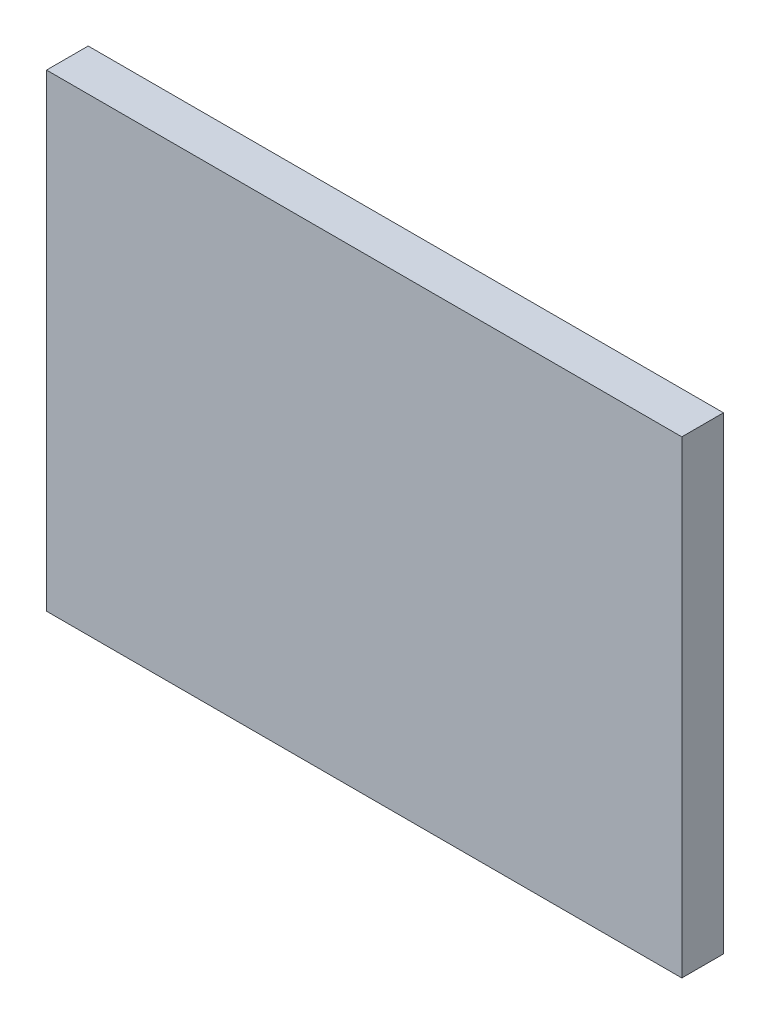
ISO-10303-21;
HEADER;
FILE_DESCRIPTION(('STEP AP214'),'2;1');
FILE_NAME('part.step','',(''),(''),'','','');
FILE_SCHEMA(('AUTOMOTIVE_DESIGN { 1 0 10303 214 1 1 1 1 }'));
ENDSEC;
DATA;
#1=APPLICATION_CONTEXT('core data for automotive mechanical design processes');
#2=APPLICATION_PROTOCOL_DEFINITION('international standard','automotive_design',2000,#1);
#3=PRODUCT_CONTEXT('',#1,'mechanical');
#4=PRODUCT('Part','Part','',(#3));
#5=PRODUCT_RELATED_PRODUCT_CATEGORY('part','',(#4));
#6=PRODUCT_DEFINITION_FORMATION('','',#4);
#7=PRODUCT_DEFINITION_CONTEXT('part definition',#1,'design');
#8=PRODUCT_DEFINITION('design','',#6,#7);
#9=PRODUCT_DEFINITION_SHAPE('','',#8);
#10=(LENGTH_UNIT() NAMED_UNIT(*) SI_UNIT(.MILLI.,.METRE.));
#11=(NAMED_UNIT(*) PLANE_ANGLE_UNIT() SI_UNIT($,.RADIAN.));
#12=(NAMED_UNIT(*) SI_UNIT($,.STERADIAN.) SOLID_ANGLE_UNIT());
#13=UNCERTAINTY_MEASURE_WITH_UNIT(LENGTH_MEASURE(1.E-05),#10,'distance_accuracy_value','');
#14=(GEOMETRIC_REPRESENTATION_CONTEXT(3) GLOBAL_UNCERTAINTY_ASSIGNED_CONTEXT((#13)) GLOBAL_UNIT_ASSIGNED_CONTEXT((#10,
#11,#12)) REPRESENTATION_CONTEXT('',''));
#15=CARTESIAN_POINT('',(0.,0.,0.));
#16=DIRECTION('',(0.,0.,1.));
#17=DIRECTION('',(1.,0.,0.));
#18=AXIS2_PLACEMENT_3D('',#15,#16,#17);
#19=CARTESIAN_POINT('',(0.,0.,4.));
#20=DIRECTION('',(1.,0.,0.));
#21=DIRECTION('',(0.,0.,-1.));
#22=AXIS2_PLACEMENT_3D('',#19,#20,#21);
#23=PLANE('',#22);
#24=DIRECTION('',(0.,-1.,0.));
#25=VECTOR('',#24,1.);
#26=CARTESIAN_POINT('',(0.,0.,0.));
#27=LINE('',#26,#25);
#28=CARTESIAN_POINT('',(0.,45.,0.));
#29=VERTEX_POINT('',#28);
#30=CARTESIAN_POINT('',(0.,0.,0.));
#31=VERTEX_POINT('',#30);
#32=EDGE_CURVE('E96',#29,#31,#27,.T.);
#33=ORIENTED_EDGE('',*,*,#32,.T.);
#34=DIRECTION('',(0.,0.,-1.));
#35=VECTOR('',#34,1.);
#36=CARTESIAN_POINT('',(0.,0.,4.));
#37=LINE('',#36,#35);
#38=CARTESIAN_POINT('',(0.,0.,4.));
#39=VERTEX_POINT('',#38);
#40=EDGE_CURVE('E11',#39,#31,#37,.T.);
#41=ORIENTED_EDGE('',*,*,#40,.F.);
#42=DIRECTION('',(0.,-1.,0.));
#43=VECTOR('',#42,1.);
#44=CARTESIAN_POINT('',(0.,0.,4.));
#45=LINE('',#44,#43);
#46=CARTESIAN_POINT('',(0.,45.,4.));
#47=VERTEX_POINT('',#46);
#48=EDGE_CURVE('E84',#47,#39,#45,.T.);
#49=ORIENTED_EDGE('',*,*,#48,.F.);
#50=DIRECTION('',(0.,0.,-1.));
#51=VECTOR('',#50,1.);
#52=CARTESIAN_POINT('',(0.,45.,4.));
#53=LINE('',#52,#51);
#54=EDGE_CURVE('E92',#47,#29,#53,.T.);
#55=ORIENTED_EDGE('',*,*,#54,.T.);
#56=EDGE_LOOP('',(#33,#41,#49,#55));
#57=FACE_BOUND('',#56,.T.);
#58=ADVANCED_FACE('F33',(#57),#23,.F.);
#59=CARTESIAN_POINT('',(0.,0.,4.));
#60=DIRECTION('',(0.,1.,0.));
#61=DIRECTION('',(0.,0.,1.));
#62=AXIS2_PLACEMENT_3D('',#59,#60,#61);
#63=PLANE('',#62);
#64=DIRECTION('',(1.,0.,0.));
#65=VECTOR('',#64,1.);
#66=CARTESIAN_POINT('',(0.,0.,0.));
#67=LINE('',#66,#65);
#68=CARTESIAN_POINT('',(61.,0.,0.));
#69=VERTEX_POINT('',#68);
#70=EDGE_CURVE('E88',#31,#69,#67,.T.);
#71=ORIENTED_EDGE('',*,*,#70,.T.);
#72=DIRECTION('',(0.,0.,-1.));
#73=VECTOR('',#72,1.);
#74=CARTESIAN_POINT('',(61.,0.,4.));
#75=LINE('',#74,#73);
#76=CARTESIAN_POINT('',(61.,0.,4.));
#77=VERTEX_POINT('',#76);
#78=EDGE_CURVE('E41',#77,#69,#75,.T.);
#79=ORIENTED_EDGE('',*,*,#78,.F.);
#80=DIRECTION('',(1.,0.,0.));
#81=VECTOR('',#80,1.);
#82=CARTESIAN_POINT('',(0.,0.,4.));
#83=LINE('',#82,#81);
#84=EDGE_CURVE('E79',#39,#77,#83,.T.);
#85=ORIENTED_EDGE('',*,*,#84,.F.);
#86=ORIENTED_EDGE('',*,*,#40,.T.);
#87=EDGE_LOOP('',(#71,#79,#85,#86));
#88=FACE_BOUND('',#87,.T.);
#89=ADVANCED_FACE('F87',(#88),#63,.F.);
#90=CARTESIAN_POINT('',(61.,0.,4.));
#91=DIRECTION('',(-1.,0.,0.));
#92=DIRECTION('',(0.,0.,1.));
#93=AXIS2_PLACEMENT_3D('',#90,#91,#92);
#94=PLANE('',#93);
#95=DIRECTION('',(0.,1.,0.));
#96=VECTOR('',#95,1.);
#97=CARTESIAN_POINT('',(61.,0.,0.));
#98=LINE('',#97,#96);
#99=CARTESIAN_POINT('',(61.,45.,0.));
#100=VERTEX_POINT('',#99);
#101=EDGE_CURVE('E66',#69,#100,#98,.T.);
#102=ORIENTED_EDGE('',*,*,#101,.T.);
#103=DIRECTION('',(0.,0.,-1.));
#104=VECTOR('',#103,1.);
#105=CARTESIAN_POINT('',(61.,45.,4.));
#106=LINE('',#105,#104);
#107=CARTESIAN_POINT('',(61.,45.,4.));
#108=VERTEX_POINT('',#107);
#109=EDGE_CURVE('E89',#108,#100,#106,.T.);
#110=ORIENTED_EDGE('',*,*,#109,.F.);
#111=DIRECTION('',(0.,1.,0.));
#112=VECTOR('',#111,1.);
#113=CARTESIAN_POINT('',(61.,0.,4.));
#114=LINE('',#113,#112);
#115=EDGE_CURVE('E82',#77,#108,#114,.T.);
#116=ORIENTED_EDGE('',*,*,#115,.F.);
#117=ORIENTED_EDGE('',*,*,#78,.T.);
#118=EDGE_LOOP('',(#102,#110,#116,#117));
#119=FACE_BOUND('',#118,.T.);
#120=ADVANCED_FACE('F90',(#119),#94,.F.);
#121=CARTESIAN_POINT('',(0.,45.,4.));
#122=DIRECTION('',(0.,-1.,0.));
#123=DIRECTION('',(0.,0.,-1.));
#124=AXIS2_PLACEMENT_3D('',#121,#122,#123);
#125=PLANE('',#124);
#126=DIRECTION('',(-1.,0.,0.));
#127=VECTOR('',#126,1.);
#128=CARTESIAN_POINT('',(0.,45.,0.));
#129=LINE('',#128,#127);
#130=EDGE_CURVE('E72',#100,#29,#129,.T.);
#131=ORIENTED_EDGE('',*,*,#130,.T.);
#132=ORIENTED_EDGE('',*,*,#54,.F.);
#133=DIRECTION('',(-1.,0.,0.));
#134=VECTOR('',#133,1.);
#135=CARTESIAN_POINT('',(0.,45.,4.));
#136=LINE('',#135,#134);
#137=EDGE_CURVE('E49',#108,#47,#136,.T.);
#138=ORIENTED_EDGE('',*,*,#137,.F.);
#139=ORIENTED_EDGE('',*,*,#109,.T.);
#140=EDGE_LOOP('',(#131,#132,#138,#139));
#141=FACE_BOUND('',#140,.T.);
#142=ADVANCED_FACE('F103',(#141),#125,.F.);
#143=CARTESIAN_POINT('',(0.,0.,4.));
#144=DIRECTION('',(0.,0.,-1.));
#145=DIRECTION('',(-1.,0.,0.));
#146=AXIS2_PLACEMENT_3D('',#143,#144,#145);
#147=PLANE('',#146);
#148=ORIENTED_EDGE('',*,*,#48,.T.);
#149=ORIENTED_EDGE('',*,*,#84,.T.);
#150=ORIENTED_EDGE('',*,*,#115,.T.);
#151=ORIENTED_EDGE('',*,*,#137,.T.);
#152=EDGE_LOOP('',(#148,#149,#150,#151));
#153=FACE_BOUND('',#152,.T.);
#154=ADVANCED_FACE('F80',(#153),#147,.F.);
#155=CARTESIAN_POINT('',(0.,0.,0.));
#156=DIRECTION('',(0.,0.,-1.));
#157=DIRECTION('',(-1.,0.,0.));
#158=AXIS2_PLACEMENT_3D('',#155,#156,#157);
#159=PLANE('',#158);
#160=ORIENTED_EDGE('',*,*,#32,.F.);
#161=ORIENTED_EDGE('',*,*,#130,.F.);
#162=ORIENTED_EDGE('',*,*,#101,.F.);
#163=ORIENTED_EDGE('',*,*,#70,.F.);
#164=EDGE_LOOP('',(#160,#161,#162,#163));
#165=FACE_BOUND('',#164,.T.);
#166=ADVANCED_FACE('F106',(#165),#159,.T.);
#167=CLOSED_SHELL('',(#58,#89,#120,#142,#154,#166));
#168=MANIFOLD_SOLID_BREP('B2',#167);
#169=ADVANCED_BREP_SHAPE_REPRESENTATION('',(#18,#168),#14);
#170=SHAPE_DEFINITION_REPRESENTATION(#9,#169);
ENDSEC;
END-ISO-10303-21;
